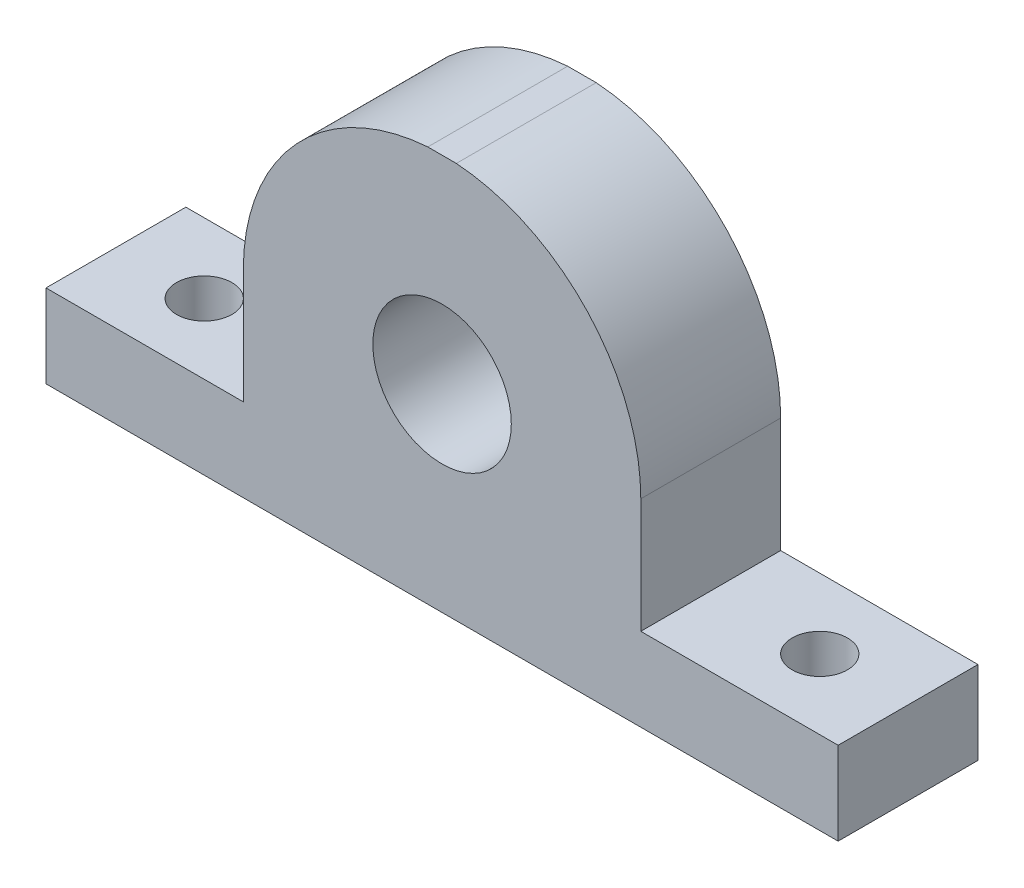
ISO-10303-21;
HEADER;
FILE_DESCRIPTION(('STEP AP214'),'2;1');
FILE_NAME('part.step','',(''),(''),'','','');
FILE_SCHEMA(('AUTOMOTIVE_DESIGN { 1 0 10303 214 1 1 1 1 }'));
ENDSEC;
DATA;
#1=APPLICATION_CONTEXT('core data for automotive mechanical design processes');
#2=APPLICATION_PROTOCOL_DEFINITION('international standard','automotive_design',2000,#1);
#3=PRODUCT_CONTEXT('',#1,'mechanical');
#4=PRODUCT('Part','Part','',(#3));
#5=PRODUCT_RELATED_PRODUCT_CATEGORY('part','',(#4));
#6=PRODUCT_DEFINITION_FORMATION('','',#4);
#7=PRODUCT_DEFINITION_CONTEXT('part definition',#1,'design');
#8=PRODUCT_DEFINITION('design','',#6,#7);
#9=PRODUCT_DEFINITION_SHAPE('','',#8);
#10=(LENGTH_UNIT() NAMED_UNIT(*) SI_UNIT(.MILLI.,.METRE.));
#11=(NAMED_UNIT(*) PLANE_ANGLE_UNIT() SI_UNIT($,.RADIAN.));
#12=(NAMED_UNIT(*) SI_UNIT($,.STERADIAN.) SOLID_ANGLE_UNIT());
#13=UNCERTAINTY_MEASURE_WITH_UNIT(LENGTH_MEASURE(1.E-05),#10,'distance_accuracy_value','');
#14=(GEOMETRIC_REPRESENTATION_CONTEXT(3) GLOBAL_UNCERTAINTY_ASSIGNED_CONTEXT((#13)) GLOBAL_UNIT_ASSIGNED_CONTEXT((#10,
#11,#12)) REPRESENTATION_CONTEXT('',''));
#15=CARTESIAN_POINT('',(0.,0.,0.));
#16=DIRECTION('',(0.,0.,1.));
#17=DIRECTION('',(1.,0.,0.));
#18=AXIS2_PLACEMENT_3D('',#15,#16,#17);
#19=CARTESIAN_POINT('',(0.,0.,10.1));
#20=DIRECTION('',(1.,0.,0.));
#21=DIRECTION('',(0.,0.,-1.));
#22=AXIS2_PLACEMENT_3D('',#19,#20,#21);
#23=PLANE('',#22);
#24=DIRECTION('',(0.,0.,-1.));
#25=VECTOR('',#24,1.);
#26=CARTESIAN_POINT('',(0.,5.99914156200398,103.655236160535));
#27=LINE('',#26,#25);
#28=CARTESIAN_POINT('',(0.,5.99914156200398,10.1));
#29=VERTEX_POINT('',#28);
#30=CARTESIAN_POINT('',(0.,5.99914156200398,0.));
#31=VERTEX_POINT('',#30);
#32=EDGE_CURVE('E131',#29,#31,#27,.T.);
#33=ORIENTED_EDGE('',*,*,#32,.T.);
#34=DIRECTION('',(0.,-1.,0.));
#35=VECTOR('',#34,1.);
#36=CARTESIAN_POINT('',(0.,0.,0.));
#37=LINE('',#36,#35);
#38=CARTESIAN_POINT('',(0.,0.,0.));
#39=VERTEX_POINT('',#38);
#40=EDGE_CURVE('E149',#31,#39,#37,.T.);
#41=ORIENTED_EDGE('',*,*,#40,.T.);
#42=DIRECTION('',(0.,0.,-1.));
#43=VECTOR('',#42,1.);
#44=CARTESIAN_POINT('',(0.,0.,10.1));
#45=LINE('',#44,#43);
#46=CARTESIAN_POINT('',(0.,0.,10.1));
#47=VERTEX_POINT('',#46);
#48=EDGE_CURVE('E172',#47,#39,#45,.T.);
#49=ORIENTED_EDGE('',*,*,#48,.F.);
#50=DIRECTION('',(0.,-1.,0.));
#51=VECTOR('',#50,1.);
#52=CARTESIAN_POINT('',(0.,0.,10.1));
#53=LINE('',#52,#51);
#54=EDGE_CURVE('E152',#29,#47,#53,.T.);
#55=ORIENTED_EDGE('',*,*,#54,.F.);
#56=EDGE_LOOP('',(#33,#41,#49,#55));
#57=FACE_BOUND('',#56,.T.);
#58=ADVANCED_FACE('F32',(#57),#23,.F.);
#59=CARTESIAN_POINT('',(57.2,0.,10.1));
#60=DIRECTION('',(-1.,0.,0.));
#61=DIRECTION('',(0.,0.,1.));
#62=AXIS2_PLACEMENT_3D('',#59,#60,#61);
#63=PLANE('',#62);
#64=DIRECTION('',(0.,0.,-1.));
#65=VECTOR('',#64,1.);
#66=CARTESIAN_POINT('',(57.2,5.99914156200398,10.1));
#67=LINE('',#66,#65);
#68=CARTESIAN_POINT('',(57.2,5.99914156200398,10.1));
#69=VERTEX_POINT('',#68);
#70=CARTESIAN_POINT('',(57.2,5.99914156200398,0.));
#71=VERTEX_POINT('',#70);
#72=EDGE_CURVE('E46',#69,#71,#67,.T.);
#73=ORIENTED_EDGE('',*,*,#72,.F.);
#74=DIRECTION('',(0.,1.,0.));
#75=VECTOR('',#74,1.);
#76=CARTESIAN_POINT('',(57.2,0.,10.1));
#77=LINE('',#76,#75);
#78=CARTESIAN_POINT('',(57.2,0.,10.1));
#79=VERTEX_POINT('',#78);
#80=EDGE_CURVE('E129',#79,#69,#77,.T.);
#81=ORIENTED_EDGE('',*,*,#80,.F.);
#82=DIRECTION('',(0.,0.,-1.));
#83=VECTOR('',#82,1.);
#84=CARTESIAN_POINT('',(57.2,0.,10.1));
#85=LINE('',#84,#83);
#86=CARTESIAN_POINT('',(57.2,0.,0.));
#87=VERTEX_POINT('',#86);
#88=EDGE_CURVE('E161',#79,#87,#85,.T.);
#89=ORIENTED_EDGE('',*,*,#88,.T.);
#90=DIRECTION('',(0.,1.,0.));
#91=VECTOR('',#90,1.);
#92=CARTESIAN_POINT('',(57.2,0.,0.));
#93=LINE('',#92,#91);
#94=EDGE_CURVE('E165',#87,#71,#93,.T.);
#95=ORIENTED_EDGE('',*,*,#94,.T.);
#96=EDGE_LOOP('',(#73,#81,#89,#95));
#97=FACE_BOUND('',#96,.T.);
#98=ADVANCED_FACE('F229',(#97),#63,.F.);
#99=CARTESIAN_POINT('',(0.,28.6,10.1));
#100=DIRECTION('',(0.,-1.,0.));
#101=DIRECTION('',(0.,0.,-1.));
#102=AXIS2_PLACEMENT_3D('',#99,#100,#101);
#103=PLANE('',#102);
#104=DIRECTION('',(0.,0.,-1.));
#105=VECTOR('',#104,1.);
#106=CARTESIAN_POINT('',(27.5701791417921,28.6,103.655236160535));
#107=LINE('',#106,#105);
#108=CARTESIAN_POINT('',(27.5701791417921,28.6,10.1));
#109=VERTEX_POINT('',#108);
#110=CARTESIAN_POINT('',(27.5701791417921,28.6,0.));
#111=VERTEX_POINT('',#110);
#112=EDGE_CURVE('E54',#109,#111,#107,.T.);
#113=ORIENTED_EDGE('',*,*,#112,.F.);
#114=DIRECTION('',(-1.,0.,0.));
#115=VECTOR('',#114,1.);
#116=CARTESIAN_POINT('',(0.,28.6,10.1));
#117=LINE('',#116,#115);
#118=CARTESIAN_POINT('',(29.6298208582079,28.6,10.1));
#119=VERTEX_POINT('',#118);
#120=EDGE_CURVE('E158',#119,#109,#117,.T.);
#121=ORIENTED_EDGE('',*,*,#120,.F.);
#122=DIRECTION('',(0.,0.,-1.));
#123=VECTOR('',#122,1.);
#124=CARTESIAN_POINT('',(29.6298208582079,28.6,103.655236160535));
#125=LINE('',#124,#123);
#126=CARTESIAN_POINT('',(29.6298208582079,28.6,0.));
#127=VERTEX_POINT('',#126);
#128=EDGE_CURVE('E138',#127,#119,#125,.F.);
#129=ORIENTED_EDGE('',*,*,#128,.F.);
#130=DIRECTION('',(-1.,0.,0.));
#131=VECTOR('',#130,1.);
#132=CARTESIAN_POINT('',(0.,28.6,0.));
#133=LINE('',#132,#131);
#134=EDGE_CURVE('E155',#127,#111,#133,.T.);
#135=ORIENTED_EDGE('',*,*,#134,.T.);
#136=EDGE_LOOP('',(#113,#121,#129,#135));
#137=FACE_BOUND('',#136,.T.);
#138=ADVANCED_FACE('F190',(#137),#103,.F.);
#139=CARTESIAN_POINT('',(0.,28.6,10.1));
#140=DIRECTION('',(0.,0.,-1.));
#141=DIRECTION('',(-1.,0.,0.));
#142=AXIS2_PLACEMENT_3D('',#139,#140,#141);
#143=PLANE('',#142);
#144=CARTESIAN_POINT('',(28.6,14.287,10.1));
#145=DIRECTION('',(0.,0.,1.));
#146=DIRECTION('',(1.,0.,0.));
#147=AXIS2_PLACEMENT_3D('',#144,#145,#146);
#148=CIRCLE('',#147,5.);
#149=CARTESIAN_POINT('',(33.6,14.287,10.1));
#150=VERTEX_POINT('',#149);
#151=EDGE_CURVE('E145',#150,#150,#148,.T.);
#152=ORIENTED_EDGE('',*,*,#151,.F.);
#153=EDGE_LOOP('',(#152));
#154=FACE_BOUND('',#153,.T.);
#155=DIRECTION('',(1.,0.,0.));
#156=VECTOR('',#155,1.);
#157=CARTESIAN_POINT('',(0.,5.99914156200398,10.1));
#158=LINE('',#157,#156);
#159=CARTESIAN_POINT('',(14.25,5.99914156200398,10.1));
#160=VERTEX_POINT('',#159);
#161=EDGE_CURVE('E143',#29,#160,#158,.T.);
#162=ORIENTED_EDGE('',*,*,#161,.F.);
#163=ORIENTED_EDGE('',*,*,#54,.T.);
#164=DIRECTION('',(1.,0.,0.));
#165=VECTOR('',#164,1.);
#166=CARTESIAN_POINT('',(0.,0.,10.1));
#167=LINE('',#166,#165);
#168=EDGE_CURVE('E154',#47,#79,#167,.T.);
#169=ORIENTED_EDGE('',*,*,#168,.T.);
#170=ORIENTED_EDGE('',*,*,#80,.T.);
#171=DIRECTION('',(1.,0.,0.));
#172=VECTOR('',#171,1.);
#173=CARTESIAN_POINT('',(0.,5.99914156200398,10.1));
#174=LINE('',#173,#172);
#175=CARTESIAN_POINT('',(42.95,5.99914156200398,10.1));
#176=VERTEX_POINT('',#175);
#177=EDGE_CURVE('E119',#176,#69,#174,.T.);
#178=ORIENTED_EDGE('',*,*,#177,.F.);
#179=DIRECTION('',(0.,-1.,0.));
#180=VECTOR('',#179,1.);
#181=CARTESIAN_POINT('',(42.95,28.6,10.1));
#182=LINE('',#181,#180);
#183=CARTESIAN_POINT('',(42.95,14.287,10.1));
#184=VERTEX_POINT('',#183);
#185=EDGE_CURVE('E109',#184,#176,#182,.T.);
#186=ORIENTED_EDGE('',*,*,#185,.F.);
#187=CARTESIAN_POINT('',(28.6,14.287,10.1));
#188=DIRECTION('',(0.,0.,-1.));
#189=DIRECTION('',(-1.,0.,0.));
#190=AXIS2_PLACEMENT_3D('',#187,#188,#189);
#191=CIRCLE('',#190,14.35);
#192=EDGE_CURVE('E139',#119,#184,#191,.T.);
#193=ORIENTED_EDGE('',*,*,#192,.F.);
#194=ORIENTED_EDGE('',*,*,#120,.T.);
#195=CARTESIAN_POINT('',(14.25,14.287,10.1));
#196=VERTEX_POINT('',#195);
#197=EDGE_CURVE('E136',#196,#109,#191,.T.);
#198=ORIENTED_EDGE('',*,*,#197,.F.);
#199=DIRECTION('',(0.,1.,0.));
#200=VECTOR('',#199,1.);
#201=CARTESIAN_POINT('',(14.25,28.6,10.1));
#202=LINE('',#201,#200);
#203=EDGE_CURVE('E141',#160,#196,#202,.T.);
#204=ORIENTED_EDGE('',*,*,#203,.F.);
#205=EDGE_LOOP('',(#162,#163,#169,#170,#178,#186,#193,#194,#198,#204));
#206=FACE_BOUND('',#205,.T.);
#207=ADVANCED_FACE('F127',(#154,#206),#143,.F.);
#208=CARTESIAN_POINT('',(0.,28.6,0.));
#209=DIRECTION('',(0.,0.,-1.));
#210=DIRECTION('',(-1.,0.,0.));
#211=AXIS2_PLACEMENT_3D('',#208,#209,#210);
#212=PLANE('',#211);
#213=CARTESIAN_POINT('',(28.6,14.287,0.));
#214=DIRECTION('',(0.,0.,1.));
#215=DIRECTION('',(1.,0.,0.));
#216=AXIS2_PLACEMENT_3D('',#213,#214,#215);
#217=CIRCLE('',#216,5.);
#218=CARTESIAN_POINT('',(33.6,14.287,0.));
#219=VERTEX_POINT('',#218);
#220=EDGE_CURVE('E146',#219,#219,#217,.T.);
#221=ORIENTED_EDGE('',*,*,#220,.T.);
#222=EDGE_LOOP('',(#221));
#223=FACE_BOUND('',#222,.T.);
#224=ORIENTED_EDGE('',*,*,#40,.F.);
#225=DIRECTION('',(1.,0.,0.));
#226=VECTOR('',#225,1.);
#227=CARTESIAN_POINT('',(0.,5.99914156200398,0.));
#228=LINE('',#227,#226);
#229=CARTESIAN_POINT('',(14.25,5.99914156200398,0.));
#230=VERTEX_POINT('',#229);
#231=EDGE_CURVE('E11',#31,#230,#228,.T.);
#232=ORIENTED_EDGE('',*,*,#231,.T.);
#233=DIRECTION('',(0.,1.,0.));
#234=VECTOR('',#233,1.);
#235=CARTESIAN_POINT('',(14.25,28.6,0.));
#236=LINE('',#235,#234);
#237=CARTESIAN_POINT('',(14.25,14.287,0.));
#238=VERTEX_POINT('',#237);
#239=EDGE_CURVE('E39',#230,#238,#236,.T.);
#240=ORIENTED_EDGE('',*,*,#239,.T.);
#241=CARTESIAN_POINT('',(28.6,14.287,0.));
#242=DIRECTION('',(0.,0.,-1.));
#243=DIRECTION('',(-1.,0.,0.));
#244=AXIS2_PLACEMENT_3D('',#241,#242,#243);
#245=CIRCLE('',#244,14.35);
#246=EDGE_CURVE('E180',#238,#111,#245,.T.);
#247=ORIENTED_EDGE('',*,*,#246,.T.);
#248=ORIENTED_EDGE('',*,*,#134,.F.);
#249=CARTESIAN_POINT('',(42.95,14.287,0.));
#250=VERTEX_POINT('',#249);
#251=EDGE_CURVE('E178',#127,#250,#245,.T.);
#252=ORIENTED_EDGE('',*,*,#251,.T.);
#253=DIRECTION('',(0.,-1.,0.));
#254=VECTOR('',#253,1.);
#255=CARTESIAN_POINT('',(42.95,28.6,0.));
#256=LINE('',#255,#254);
#257=CARTESIAN_POINT('',(42.95,5.99914156200398,0.));
#258=VERTEX_POINT('',#257);
#259=EDGE_CURVE('E176',#250,#258,#256,.T.);
#260=ORIENTED_EDGE('',*,*,#259,.T.);
#261=DIRECTION('',(1.,0.,0.));
#262=VECTOR('',#261,1.);
#263=CARTESIAN_POINT('',(0.,5.99914156200398,0.));
#264=LINE('',#263,#262);
#265=EDGE_CURVE('E122',#258,#71,#264,.T.);
#266=ORIENTED_EDGE('',*,*,#265,.T.);
#267=ORIENTED_EDGE('',*,*,#94,.F.);
#268=DIRECTION('',(1.,0.,0.));
#269=VECTOR('',#268,1.);
#270=CARTESIAN_POINT('',(0.,0.,0.));
#271=LINE('',#270,#269);
#272=EDGE_CURVE('E163',#39,#87,#271,.T.);
#273=ORIENTED_EDGE('',*,*,#272,.F.);
#274=EDGE_LOOP('',(#224,#232,#240,#247,#248,#252,#260,#266,#267,#273));
#275=FACE_BOUND('',#274,.T.);
#276=ADVANCED_FACE('F185',(#223,#275),#212,.T.);
#277=CARTESIAN_POINT('',(0.,0.,10.1));
#278=DIRECTION('',(0.,1.,0.));
#279=DIRECTION('',(0.,0.,1.));
#280=AXIS2_PLACEMENT_3D('',#277,#278,#279);
#281=PLANE('',#280);
#282=CARTESIAN_POINT('',(6.375,0.,5.05));
#283=DIRECTION('',(0.,1.,0.));
#284=DIRECTION('',(0.,0.,1.));
#285=AXIS2_PLACEMENT_3D('',#282,#283,#284);
#286=CIRCLE('',#285,2.);
#287=CARTESIAN_POINT('',(6.375,0.,7.05));
#288=VERTEX_POINT('',#287);
#289=EDGE_CURVE('E253',#288,#288,#286,.T.);
#290=ORIENTED_EDGE('',*,*,#289,.T.);
#291=EDGE_LOOP('',(#290));
#292=FACE_BOUND('',#291,.T.);
#293=CARTESIAN_POINT('',(50.825,0.,5.05));
#294=DIRECTION('',(0.,1.,0.));
#295=DIRECTION('',(0.,0.,1.));
#296=AXIS2_PLACEMENT_3D('',#293,#294,#295);
#297=CIRCLE('',#296,2.);
#298=CARTESIAN_POINT('',(50.825,0.,7.05));
#299=VERTEX_POINT('',#298);
#300=EDGE_CURVE('E123',#299,#299,#297,.T.);
#301=ORIENTED_EDGE('',*,*,#300,.T.);
#302=EDGE_LOOP('',(#301));
#303=FACE_BOUND('',#302,.T.);
#304=ORIENTED_EDGE('',*,*,#272,.T.);
#305=ORIENTED_EDGE('',*,*,#88,.F.);
#306=ORIENTED_EDGE('',*,*,#168,.F.);
#307=ORIENTED_EDGE('',*,*,#48,.T.);
#308=EDGE_LOOP('',(#304,#305,#306,#307));
#309=FACE_BOUND('',#308,.T.);
#310=ADVANCED_FACE('F214',(#292,#303,#309),#281,.F.);
#311=CARTESIAN_POINT('',(28.6,14.287,0.));
#312=DIRECTION('',(0.,0.,1.));
#313=DIRECTION('',(1.,0.,0.));
#314=AXIS2_PLACEMENT_3D('',#311,#312,#313);
#315=CYLINDRICAL_SURFACE('',#314,5.);
#316=ORIENTED_EDGE('',*,*,#220,.F.);
#317=EDGE_LOOP('',(#316));
#318=FACE_BOUND('',#317,.T.);
#319=ORIENTED_EDGE('',*,*,#151,.T.);
#320=EDGE_LOOP('',(#319));
#321=FACE_BOUND('',#320,.T.);
#322=ADVANCED_FACE('F241',(#318,#321),#315,.F.);
#323=CARTESIAN_POINT('',(42.95,5.99914156200398,103.655236160535));
#324=DIRECTION('',(0.,1.,0.));
#325=DIRECTION('',(0.,0.,1.));
#326=AXIS2_PLACEMENT_3D('',#323,#324,#325);
#327=PLANE('',#326);
#328=CARTESIAN_POINT('',(50.825,5.99914156200398,5.05));
#329=DIRECTION('',(0.,1.,0.));
#330=DIRECTION('',(0.,0.,1.));
#331=AXIS2_PLACEMENT_3D('',#328,#329,#330);
#332=CIRCLE('',#331,2.);
#333=CARTESIAN_POINT('',(50.825,5.99914156200398,7.05));
#334=VERTEX_POINT('',#333);
#335=EDGE_CURVE('E257',#334,#334,#332,.T.);
#336=ORIENTED_EDGE('',*,*,#335,.F.);
#337=EDGE_LOOP('',(#336));
#338=FACE_BOUND('',#337,.T.);
#339=DIRECTION('',(0.,0.,-1.));
#340=VECTOR('',#339,1.);
#341=CARTESIAN_POINT('',(42.95,5.99914156200398,103.655236160535));
#342=LINE('',#341,#340);
#343=EDGE_CURVE('E112',#176,#258,#342,.T.);
#344=ORIENTED_EDGE('',*,*,#343,.F.);
#345=ORIENTED_EDGE('',*,*,#177,.T.);
#346=ORIENTED_EDGE('',*,*,#72,.T.);
#347=ORIENTED_EDGE('',*,*,#265,.F.);
#348=EDGE_LOOP('',(#344,#345,#346,#347));
#349=FACE_BOUND('',#348,.T.);
#350=ADVANCED_FACE('F121',(#338,#349),#327,.T.);
#351=CARTESIAN_POINT('',(42.95,14.287,103.655236160535));
#352=DIRECTION('',(1.,0.,0.));
#353=DIRECTION('',(0.,0.,-1.));
#354=AXIS2_PLACEMENT_3D('',#351,#352,#353);
#355=PLANE('',#354);
#356=DIRECTION('',(0.,0.,-1.));
#357=VECTOR('',#356,1.);
#358=CARTESIAN_POINT('',(42.95,14.287,103.655236160535));
#359=LINE('',#358,#357);
#360=EDGE_CURVE('E115',#184,#250,#359,.T.);
#361=ORIENTED_EDGE('',*,*,#360,.F.);
#362=ORIENTED_EDGE('',*,*,#185,.T.);
#363=ORIENTED_EDGE('',*,*,#343,.T.);
#364=ORIENTED_EDGE('',*,*,#259,.F.);
#365=EDGE_LOOP('',(#361,#362,#363,#364));
#366=FACE_BOUND('',#365,.T.);
#367=ADVANCED_FACE('F111',(#366),#355,.T.);
#368=CARTESIAN_POINT('',(28.6,14.287,103.655236160535));
#369=DIRECTION('',(0.,0.,-1.));
#370=DIRECTION('',(-1.,0.,0.));
#371=AXIS2_PLACEMENT_3D('',#368,#369,#370);
#372=CYLINDRICAL_SURFACE('',#371,14.35);
#373=ORIENTED_EDGE('',*,*,#128,.T.);
#374=ORIENTED_EDGE('',*,*,#192,.T.);
#375=ORIENTED_EDGE('',*,*,#360,.T.);
#376=ORIENTED_EDGE('',*,*,#251,.F.);
#377=EDGE_LOOP('',(#373,#374,#375,#376));
#378=FACE_BOUND('',#377,.T.);
#379=ADVANCED_FACE('F193',(#378),#372,.T.);
#380=CARTESIAN_POINT('',(0.,5.99914156200398,103.655236160535));
#381=DIRECTION('',(0.,1.,0.));
#382=DIRECTION('',(0.,0.,1.));
#383=AXIS2_PLACEMENT_3D('',#380,#381,#382);
#384=PLANE('',#383);
#385=CARTESIAN_POINT('',(6.375,5.99914156200398,5.05));
#386=DIRECTION('',(0.,1.,0.));
#387=DIRECTION('',(0.,0.,1.));
#388=AXIS2_PLACEMENT_3D('',#385,#386,#387);
#389=CIRCLE('',#388,2.);
#390=CARTESIAN_POINT('',(6.375,5.99914156200398,7.05));
#391=VERTEX_POINT('',#390);
#392=EDGE_CURVE('E260',#391,#391,#389,.T.);
#393=ORIENTED_EDGE('',*,*,#392,.F.);
#394=EDGE_LOOP('',(#393));
#395=FACE_BOUND('',#394,.T.);
#396=ORIENTED_EDGE('',*,*,#32,.F.);
#397=ORIENTED_EDGE('',*,*,#161,.T.);
#398=DIRECTION('',(0.,0.,-1.));
#399=VECTOR('',#398,1.);
#400=CARTESIAN_POINT('',(14.25,5.99914156200398,103.655236160535));
#401=LINE('',#400,#399);
#402=EDGE_CURVE('E199',#160,#230,#401,.T.);
#403=ORIENTED_EDGE('',*,*,#402,.T.);
#404=ORIENTED_EDGE('',*,*,#231,.F.);
#405=EDGE_LOOP('',(#396,#397,#403,#404));
#406=FACE_BOUND('',#405,.T.);
#407=ADVANCED_FACE('F216',(#395,#406),#384,.T.);
#408=CARTESIAN_POINT('',(14.25,5.99914156200398,103.655236160535));
#409=DIRECTION('',(-1.,0.,0.));
#410=DIRECTION('',(0.,0.,1.));
#411=AXIS2_PLACEMENT_3D('',#408,#409,#410);
#412=PLANE('',#411);
#413=ORIENTED_EDGE('',*,*,#402,.F.);
#414=ORIENTED_EDGE('',*,*,#203,.T.);
#415=DIRECTION('',(0.,0.,-1.));
#416=VECTOR('',#415,1.);
#417=CARTESIAN_POINT('',(14.25,14.287,103.655236160535));
#418=LINE('',#417,#416);
#419=EDGE_CURVE('E197',#196,#238,#418,.T.);
#420=ORIENTED_EDGE('',*,*,#419,.T.);
#421=ORIENTED_EDGE('',*,*,#239,.F.);
#422=EDGE_LOOP('',(#413,#414,#420,#421));
#423=FACE_BOUND('',#422,.T.);
#424=ADVANCED_FACE('F217',(#423),#412,.T.);
#425=ORIENTED_EDGE('',*,*,#419,.F.);
#426=ORIENTED_EDGE('',*,*,#197,.T.);
#427=ORIENTED_EDGE('',*,*,#112,.T.);
#428=ORIENTED_EDGE('',*,*,#246,.F.);
#429=EDGE_LOOP('',(#425,#426,#427,#428));
#430=FACE_BOUND('',#429,.T.);
#431=ADVANCED_FACE('F196',(#430),#372,.T.);
#432=CARTESIAN_POINT('',(50.825,0.,5.05));
#433=DIRECTION('',(0.,1.,0.));
#434=DIRECTION('',(0.,0.,1.));
#435=AXIS2_PLACEMENT_3D('',#432,#433,#434);
#436=CYLINDRICAL_SURFACE('',#435,2.);
#437=ORIENTED_EDGE('',*,*,#300,.F.);
#438=EDGE_LOOP('',(#437));
#439=FACE_BOUND('',#438,.T.);
#440=ORIENTED_EDGE('',*,*,#335,.T.);
#441=EDGE_LOOP('',(#440));
#442=FACE_BOUND('',#441,.T.);
#443=ADVANCED_FACE('F224',(#439,#442),#436,.F.);
#444=CARTESIAN_POINT('',(6.375,0.,5.05));
#445=DIRECTION('',(0.,1.,0.));
#446=DIRECTION('',(0.,0.,1.));
#447=AXIS2_PLACEMENT_3D('',#444,#445,#446);
#448=CYLINDRICAL_SURFACE('',#447,2.);
#449=ORIENTED_EDGE('',*,*,#289,.F.);
#450=EDGE_LOOP('',(#449));
#451=FACE_BOUND('',#450,.T.);
#452=ORIENTED_EDGE('',*,*,#392,.T.);
#453=EDGE_LOOP('',(#452));
#454=FACE_BOUND('',#453,.T.);
#455=ADVANCED_FACE('F267',(#451,#454),#448,.F.);
#456=CLOSED_SHELL('',(#58,#98,#138,#207,#276,#310,#322,#350,#367,#379,#407,#424,#431,#443,#455));
#457=MANIFOLD_SOLID_BREP('B2',#456);
#458=ADVANCED_BREP_SHAPE_REPRESENTATION('',(#18,#457),#14);
#459=SHAPE_DEFINITION_REPRESENTATION(#9,#458);
ENDSEC;
END-ISO-10303-21;
